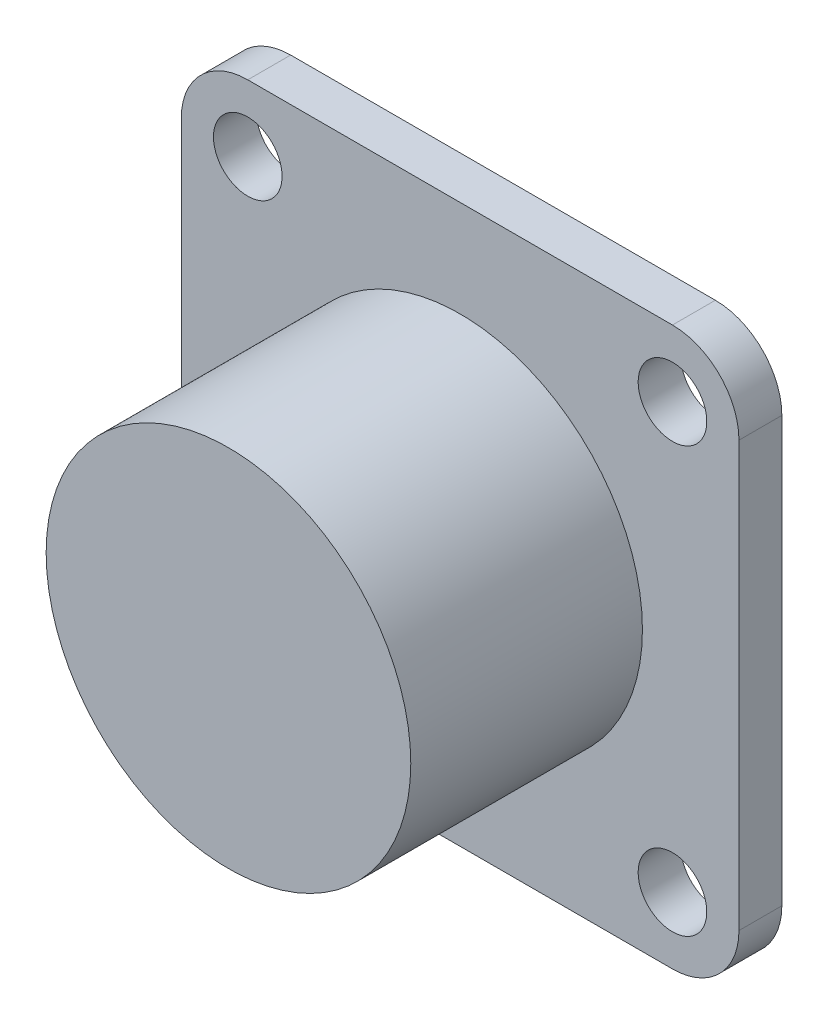
ISO-10303-21;
HEADER;
FILE_DESCRIPTION(('STEP AP214'),'2;1');
FILE_NAME('part.step','',(''),(''),'','','');
FILE_SCHEMA(('AUTOMOTIVE_DESIGN { 1 0 10303 214 1 1 1 1 }'));
ENDSEC;
DATA;
#1=APPLICATION_CONTEXT('core data for automotive mechanical design processes');
#2=APPLICATION_PROTOCOL_DEFINITION('international standard','automotive_design',2000,#1);
#3=PRODUCT_CONTEXT('',#1,'mechanical');
#4=PRODUCT('Part','Part','',(#3));
#5=PRODUCT_RELATED_PRODUCT_CATEGORY('part','',(#4));
#6=PRODUCT_DEFINITION_FORMATION('','',#4);
#7=PRODUCT_DEFINITION_CONTEXT('part definition',#1,'design');
#8=PRODUCT_DEFINITION('design','',#6,#7);
#9=PRODUCT_DEFINITION_SHAPE('','',#8);
#10=(LENGTH_UNIT() NAMED_UNIT(*) SI_UNIT(.MILLI.,.METRE.));
#11=(NAMED_UNIT(*) PLANE_ANGLE_UNIT() SI_UNIT($,.RADIAN.));
#12=(NAMED_UNIT(*) SI_UNIT($,.STERADIAN.) SOLID_ANGLE_UNIT());
#13=UNCERTAINTY_MEASURE_WITH_UNIT(LENGTH_MEASURE(1.E-05),#10,'distance_accuracy_value','');
#14=(GEOMETRIC_REPRESENTATION_CONTEXT(3) GLOBAL_UNCERTAINTY_ASSIGNED_CONTEXT((#13)) GLOBAL_UNIT_ASSIGNED_CONTEXT((#10,
#11,#12)) REPRESENTATION_CONTEXT('',''));
#15=CARTESIAN_POINT('',(0.,0.,0.));
#16=DIRECTION('',(0.,0.,1.));
#17=DIRECTION('',(1.,0.,0.));
#18=AXIS2_PLACEMENT_3D('',#15,#16,#17);
#19=CARTESIAN_POINT('',(13.,-13.,2.));
#20=DIRECTION('',(-1.,0.,0.));
#21=DIRECTION('',(0.,0.,1.));
#22=AXIS2_PLACEMENT_3D('',#19,#20,#21);
#23=PLANE('',#22);
#24=DIRECTION('',(0.,1.,0.));
#25=VECTOR('',#24,1.);
#26=CARTESIAN_POINT('',(13.,-13.,0.));
#27=LINE('',#26,#25);
#28=CARTESIAN_POINT('',(13.,-9.9,0.));
#29=VERTEX_POINT('',#28);
#30=CARTESIAN_POINT('',(13.,9.89999999999999,0.));
#31=VERTEX_POINT('',#30);
#32=EDGE_CURVE('E130',#29,#31,#27,.T.);
#33=ORIENTED_EDGE('',*,*,#32,.T.);
#34=DIRECTION('',(0.,0.,-1.));
#35=VECTOR('',#34,1.);
#36=CARTESIAN_POINT('',(13.,9.9,2.));
#37=LINE('',#36,#35);
#38=CARTESIAN_POINT('',(13.,9.89999999999999,2.));
#39=VERTEX_POINT('',#38);
#40=EDGE_CURVE('E108',#31,#39,#37,.F.);
#41=ORIENTED_EDGE('',*,*,#40,.T.);
#42=DIRECTION('',(0.,1.,0.));
#43=VECTOR('',#42,1.);
#44=CARTESIAN_POINT('',(13.,-13.,2.));
#45=LINE('',#44,#43);
#46=CARTESIAN_POINT('',(13.,-9.9,2.));
#47=VERTEX_POINT('',#46);
#48=EDGE_CURVE('E140',#47,#39,#45,.T.);
#49=ORIENTED_EDGE('',*,*,#48,.F.);
#50=DIRECTION('',(0.,0.,-1.));
#51=VECTOR('',#50,1.);
#52=CARTESIAN_POINT('',(13.,-9.9,2.));
#53=LINE('',#52,#51);
#54=EDGE_CURVE('E113',#47,#29,#53,.T.);
#55=ORIENTED_EDGE('',*,*,#54,.T.);
#56=EDGE_LOOP('',(#33,#41,#49,#55));
#57=FACE_BOUND('',#56,.T.);
#58=ADVANCED_FACE('F35',(#57),#23,.F.);
#59=CARTESIAN_POINT('',(-13.,13.,2.));
#60=DIRECTION('',(0.,-1.,0.));
#61=DIRECTION('',(0.,0.,-1.));
#62=AXIS2_PLACEMENT_3D('',#59,#60,#61);
#63=PLANE('',#62);
#64=DIRECTION('',(-1.,0.,0.));
#65=VECTOR('',#64,1.);
#66=CARTESIAN_POINT('',(-13.,13.,2.));
#67=LINE('',#66,#65);
#68=CARTESIAN_POINT('',(9.9,13.,2.));
#69=VERTEX_POINT('',#68);
#70=CARTESIAN_POINT('',(-9.9,13.,2.));
#71=VERTEX_POINT('',#70);
#72=EDGE_CURVE('E123',#69,#71,#67,.T.);
#73=ORIENTED_EDGE('',*,*,#72,.F.);
#74=DIRECTION('',(0.,0.,-1.));
#75=VECTOR('',#74,1.);
#76=CARTESIAN_POINT('',(9.9,13.,2.));
#77=LINE('',#76,#75);
#78=CARTESIAN_POINT('',(9.9,13.,0.));
#79=VERTEX_POINT('',#78);
#80=EDGE_CURVE('E107',#69,#79,#77,.T.);
#81=ORIENTED_EDGE('',*,*,#80,.T.);
#82=DIRECTION('',(-1.,0.,0.));
#83=VECTOR('',#82,1.);
#84=CARTESIAN_POINT('',(-13.,13.,0.));
#85=LINE('',#84,#83);
#86=CARTESIAN_POINT('',(-9.9,13.,0.));
#87=VERTEX_POINT('',#86);
#88=EDGE_CURVE('E120',#79,#87,#85,.T.);
#89=ORIENTED_EDGE('',*,*,#88,.T.);
#90=DIRECTION('',(0.,0.,-1.));
#91=VECTOR('',#90,1.);
#92=CARTESIAN_POINT('',(-9.89999999999999,13.,2.));
#93=LINE('',#92,#91);
#94=EDGE_CURVE('E125',#87,#71,#93,.F.);
#95=ORIENTED_EDGE('',*,*,#94,.T.);
#96=EDGE_LOOP('',(#73,#81,#89,#95));
#97=FACE_BOUND('',#96,.T.);
#98=ADVANCED_FACE('F119',(#97),#63,.F.);
#99=CARTESIAN_POINT('',(-13.,-13.,2.));
#100=DIRECTION('',(1.,0.,0.));
#101=DIRECTION('',(0.,0.,-1.));
#102=AXIS2_PLACEMENT_3D('',#99,#100,#101);
#103=PLANE('',#102);
#104=DIRECTION('',(0.,-1.,0.));
#105=VECTOR('',#104,1.);
#106=CARTESIAN_POINT('',(-13.,-13.,0.));
#107=LINE('',#106,#105);
#108=CARTESIAN_POINT('',(-13.,9.89999999999999,0.));
#109=VERTEX_POINT('',#108);
#110=CARTESIAN_POINT('',(-13.,-9.9,0.));
#111=VERTEX_POINT('',#110);
#112=EDGE_CURVE('E129',#109,#111,#107,.T.);
#113=ORIENTED_EDGE('',*,*,#112,.T.);
#114=DIRECTION('',(0.,0.,-1.));
#115=VECTOR('',#114,1.);
#116=CARTESIAN_POINT('',(-13.,-9.9,2.));
#117=LINE('',#116,#115);
#118=CARTESIAN_POINT('',(-13.,-9.9,2.));
#119=VERTEX_POINT('',#118);
#120=EDGE_CURVE('E39',#111,#119,#117,.F.);
#121=ORIENTED_EDGE('',*,*,#120,.T.);
#122=DIRECTION('',(0.,-1.,0.));
#123=VECTOR('',#122,1.);
#124=CARTESIAN_POINT('',(-13.,-13.,2.));
#125=LINE('',#124,#123);
#126=CARTESIAN_POINT('',(-13.,9.89999999999999,2.));
#127=VERTEX_POINT('',#126);
#128=EDGE_CURVE('E167',#127,#119,#125,.T.);
#129=ORIENTED_EDGE('',*,*,#128,.F.);
#130=DIRECTION('',(0.,0.,-1.));
#131=VECTOR('',#130,1.);
#132=CARTESIAN_POINT('',(-13.,9.9,2.));
#133=LINE('',#132,#131);
#134=EDGE_CURVE('E160',#127,#109,#133,.T.);
#135=ORIENTED_EDGE('',*,*,#134,.T.);
#136=EDGE_LOOP('',(#113,#121,#129,#135));
#137=FACE_BOUND('',#136,.T.);
#138=ADVANCED_FACE('F166',(#137),#103,.F.);
#139=CARTESIAN_POINT('',(-13.,-13.,2.));
#140=DIRECTION('',(0.,1.,0.));
#141=DIRECTION('',(0.,0.,1.));
#142=AXIS2_PLACEMENT_3D('',#139,#140,#141);
#143=PLANE('',#142);
#144=DIRECTION('',(1.,0.,0.));
#145=VECTOR('',#144,1.);
#146=CARTESIAN_POINT('',(-13.,-13.,0.));
#147=LINE('',#146,#145);
#148=CARTESIAN_POINT('',(-9.9,-13.,0.));
#149=VERTEX_POINT('',#148);
#150=CARTESIAN_POINT('',(9.9,-13.,0.));
#151=VERTEX_POINT('',#150);
#152=EDGE_CURVE('E133',#149,#151,#147,.T.);
#153=ORIENTED_EDGE('',*,*,#152,.T.);
#154=DIRECTION('',(0.,0.,-1.));
#155=VECTOR('',#154,1.);
#156=CARTESIAN_POINT('',(9.9,-13.,2.));
#157=LINE('',#156,#155);
#158=CARTESIAN_POINT('',(9.9,-13.,2.));
#159=VERTEX_POINT('',#158);
#160=EDGE_CURVE('E51',#151,#159,#157,.F.);
#161=ORIENTED_EDGE('',*,*,#160,.T.);
#162=DIRECTION('',(1.,0.,0.));
#163=VECTOR('',#162,1.);
#164=CARTESIAN_POINT('',(-13.,-13.,2.));
#165=LINE('',#164,#163);
#166=CARTESIAN_POINT('',(-9.9,-13.,2.));
#167=VERTEX_POINT('',#166);
#168=EDGE_CURVE('E141',#167,#159,#165,.T.);
#169=ORIENTED_EDGE('',*,*,#168,.F.);
#170=DIRECTION('',(0.,0.,-1.));
#171=VECTOR('',#170,1.);
#172=CARTESIAN_POINT('',(-9.89999999999999,-13.,2.));
#173=LINE('',#172,#171);
#174=EDGE_CURVE('E157',#167,#149,#173,.T.);
#175=ORIENTED_EDGE('',*,*,#174,.T.);
#176=EDGE_LOOP('',(#153,#161,#169,#175));
#177=FACE_BOUND('',#176,.T.);
#178=ADVANCED_FACE('F176',(#177),#143,.F.);
#179=CARTESIAN_POINT('',(0.,0.,2.));
#180=DIRECTION('',(0.,0.,-1.));
#181=DIRECTION('',(-1.,0.,0.));
#182=AXIS2_PLACEMENT_3D('',#179,#180,#181);
#183=PLANE('',#182);
#184=CARTESIAN_POINT('',(-9.89999999999999,9.9,2.));
#185=DIRECTION('',(0.,0.,-1.));
#186=DIRECTION('',(-1.,0.,0.));
#187=AXIS2_PLACEMENT_3D('',#184,#185,#186);
#188=CIRCLE('',#187,1.59999999999999);
#189=CARTESIAN_POINT('',(-11.5,9.9,2.));
#190=VERTEX_POINT('',#189);
#191=EDGE_CURVE('E206',#190,#190,#188,.T.);
#192=ORIENTED_EDGE('',*,*,#191,.T.);
#193=EDGE_LOOP('',(#192));
#194=FACE_BOUND('',#193,.T.);
#195=CARTESIAN_POINT('',(-9.89999999999999,-9.9,2.));
#196=DIRECTION('',(0.,0.,-1.));
#197=DIRECTION('',(-1.,0.,0.));
#198=AXIS2_PLACEMENT_3D('',#195,#196,#197);
#199=CIRCLE('',#198,1.59999999999999);
#200=CARTESIAN_POINT('',(-11.5,-9.9,2.));
#201=VERTEX_POINT('',#200);
#202=EDGE_CURVE('E200',#201,#201,#199,.T.);
#203=ORIENTED_EDGE('',*,*,#202,.T.);
#204=EDGE_LOOP('',(#203));
#205=FACE_BOUND('',#204,.T.);
#206=CARTESIAN_POINT('',(9.9,-9.9,2.));
#207=DIRECTION('',(0.,0.,-1.));
#208=DIRECTION('',(-1.,0.,0.));
#209=AXIS2_PLACEMENT_3D('',#206,#207,#208);
#210=CIRCLE('',#209,1.59999999999999);
#211=CARTESIAN_POINT('',(8.30000000000001,-9.9,2.));
#212=VERTEX_POINT('',#211);
#213=EDGE_CURVE('E194',#212,#212,#210,.T.);
#214=ORIENTED_EDGE('',*,*,#213,.T.);
#215=EDGE_LOOP('',(#214));
#216=FACE_BOUND('',#215,.T.);
#217=CARTESIAN_POINT('',(9.9,9.9,2.));
#218=DIRECTION('',(0.,0.,-1.));
#219=DIRECTION('',(-1.,0.,0.));
#220=AXIS2_PLACEMENT_3D('',#217,#218,#219);
#221=CIRCLE('',#220,1.59999999999999);
#222=CARTESIAN_POINT('',(8.30000000000001,9.9,2.));
#223=VERTEX_POINT('',#222);
#224=EDGE_CURVE('E188',#223,#223,#221,.T.);
#225=ORIENTED_EDGE('',*,*,#224,.T.);
#226=EDGE_LOOP('',(#225));
#227=FACE_BOUND('',#226,.T.);
#228=CARTESIAN_POINT('',(0.,0.,2.));
#229=DIRECTION('',(0.,0.,-1.));
#230=DIRECTION('',(-1.,0.,0.));
#231=AXIS2_PLACEMENT_3D('',#228,#229,#230);
#232=CIRCLE('',#231,8.5);
#233=CARTESIAN_POINT('',(-8.5,0.,2.));
#234=VERTEX_POINT('',#233);
#235=EDGE_CURVE('E12',#234,#234,#232,.F.);
#236=ORIENTED_EDGE('',*,*,#235,.F.);
#237=EDGE_LOOP('',(#236));
#238=FACE_BOUND('',#237,.T.);
#239=ORIENTED_EDGE('',*,*,#48,.T.);
#240=CARTESIAN_POINT('',(9.9,9.9,2.));
#241=DIRECTION('',(0.,0.,-1.));
#242=DIRECTION('',(-1.,0.,0.));
#243=AXIS2_PLACEMENT_3D('',#240,#241,#242);
#244=CIRCLE('',#243,3.1);
#245=EDGE_CURVE('E155',#39,#69,#244,.F.);
#246=ORIENTED_EDGE('',*,*,#245,.T.);
#247=ORIENTED_EDGE('',*,*,#72,.T.);
#248=CARTESIAN_POINT('',(-9.89999999999999,9.9,2.));
#249=DIRECTION('',(0.,0.,-1.));
#250=DIRECTION('',(-1.,0.,0.));
#251=AXIS2_PLACEMENT_3D('',#248,#249,#250);
#252=CIRCLE('',#251,3.1);
#253=EDGE_CURVE('E150',#71,#127,#252,.F.);
#254=ORIENTED_EDGE('',*,*,#253,.T.);
#255=ORIENTED_EDGE('',*,*,#128,.T.);
#256=CARTESIAN_POINT('',(-9.89999999999999,-9.9,2.));
#257=DIRECTION('',(0.,0.,-1.));
#258=DIRECTION('',(-1.,0.,0.));
#259=AXIS2_PLACEMENT_3D('',#256,#257,#258);
#260=CIRCLE('',#259,3.1);
#261=EDGE_CURVE('E58',#119,#167,#260,.F.);
#262=ORIENTED_EDGE('',*,*,#261,.T.);
#263=ORIENTED_EDGE('',*,*,#168,.T.);
#264=CARTESIAN_POINT('',(9.9,-9.9,2.));
#265=DIRECTION('',(0.,0.,-1.));
#266=DIRECTION('',(-1.,0.,0.));
#267=AXIS2_PLACEMENT_3D('',#264,#265,#266);
#268=CIRCLE('',#267,3.1);
#269=EDGE_CURVE('E153',#159,#47,#268,.F.);
#270=ORIENTED_EDGE('',*,*,#269,.T.);
#271=EDGE_LOOP('',(#239,#246,#247,#254,#255,#262,#263,#270));
#272=FACE_BOUND('',#271,.T.);
#273=ADVANCED_FACE('F170',(#194,#205,#216,#227,#238,#272),#183,.F.);
#274=CARTESIAN_POINT('',(0.,0.,0.));
#275=DIRECTION('',(0.,0.,-1.));
#276=DIRECTION('',(-1.,0.,0.));
#277=AXIS2_PLACEMENT_3D('',#274,#275,#276);
#278=PLANE('',#277);
#279=CARTESIAN_POINT('',(0.,0.,0.));
#280=DIRECTION('',(0.,0.,-1.));
#281=DIRECTION('',(-1.,0.,0.));
#282=AXIS2_PLACEMENT_3D('',#279,#280,#281);
#283=CIRCLE('',#282,8.);
#284=CARTESIAN_POINT('',(-8.,0.,0.));
#285=VERTEX_POINT('',#284);
#286=EDGE_CURVE('E219',#285,#285,#283,.T.);
#287=ORIENTED_EDGE('',*,*,#286,.F.);
#288=EDGE_LOOP('',(#287));
#289=FACE_BOUND('',#288,.T.);
#290=CARTESIAN_POINT('',(-9.89999999999999,9.9,0.));
#291=DIRECTION('',(0.,0.,-1.));
#292=DIRECTION('',(-1.,0.,0.));
#293=AXIS2_PLACEMENT_3D('',#290,#291,#292);
#294=CIRCLE('',#293,1.59999999999999);
#295=CARTESIAN_POINT('',(-11.5,9.9,0.));
#296=VERTEX_POINT('',#295);
#297=EDGE_CURVE('E209',#296,#296,#294,.T.);
#298=ORIENTED_EDGE('',*,*,#297,.F.);
#299=EDGE_LOOP('',(#298));
#300=FACE_BOUND('',#299,.T.);
#301=CARTESIAN_POINT('',(-9.89999999999999,-9.9,0.));
#302=DIRECTION('',(0.,0.,-1.));
#303=DIRECTION('',(-1.,0.,0.));
#304=AXIS2_PLACEMENT_3D('',#301,#302,#303);
#305=CIRCLE('',#304,1.59999999999999);
#306=CARTESIAN_POINT('',(-11.5,-9.9,0.));
#307=VERTEX_POINT('',#306);
#308=EDGE_CURVE('E203',#307,#307,#305,.T.);
#309=ORIENTED_EDGE('',*,*,#308,.F.);
#310=EDGE_LOOP('',(#309));
#311=FACE_BOUND('',#310,.T.);
#312=CARTESIAN_POINT('',(9.9,-9.9,0.));
#313=DIRECTION('',(0.,0.,-1.));
#314=DIRECTION('',(-1.,0.,0.));
#315=AXIS2_PLACEMENT_3D('',#312,#313,#314);
#316=CIRCLE('',#315,1.59999999999999);
#317=CARTESIAN_POINT('',(8.30000000000001,-9.9,0.));
#318=VERTEX_POINT('',#317);
#319=EDGE_CURVE('E197',#318,#318,#316,.T.);
#320=ORIENTED_EDGE('',*,*,#319,.F.);
#321=EDGE_LOOP('',(#320));
#322=FACE_BOUND('',#321,.T.);
#323=CARTESIAN_POINT('',(9.9,9.9,0.));
#324=DIRECTION('',(0.,0.,-1.));
#325=DIRECTION('',(-1.,0.,0.));
#326=AXIS2_PLACEMENT_3D('',#323,#324,#325);
#327=CIRCLE('',#326,1.59999999999999);
#328=CARTESIAN_POINT('',(8.30000000000001,9.9,0.));
#329=VERTEX_POINT('',#328);
#330=EDGE_CURVE('E191',#329,#329,#327,.T.);
#331=ORIENTED_EDGE('',*,*,#330,.F.);
#332=EDGE_LOOP('',(#331));
#333=FACE_BOUND('',#332,.T.);
#334=ORIENTED_EDGE('',*,*,#88,.F.);
#335=CARTESIAN_POINT('',(9.9,9.9,0.));
#336=DIRECTION('',(0.,0.,-1.));
#337=DIRECTION('',(-1.,0.,0.));
#338=AXIS2_PLACEMENT_3D('',#335,#336,#337);
#339=CIRCLE('',#338,3.1);
#340=EDGE_CURVE('E103',#79,#31,#339,.T.);
#341=ORIENTED_EDGE('',*,*,#340,.T.);
#342=ORIENTED_EDGE('',*,*,#32,.F.);
#343=CARTESIAN_POINT('',(9.9,-9.9,0.));
#344=DIRECTION('',(0.,0.,-1.));
#345=DIRECTION('',(-1.,0.,0.));
#346=AXIS2_PLACEMENT_3D('',#343,#344,#345);
#347=CIRCLE('',#346,3.1);
#348=EDGE_CURVE('E114',#29,#151,#347,.T.);
#349=ORIENTED_EDGE('',*,*,#348,.T.);
#350=ORIENTED_EDGE('',*,*,#152,.F.);
#351=CARTESIAN_POINT('',(-9.89999999999999,-9.9,0.));
#352=DIRECTION('',(0.,0.,-1.));
#353=DIRECTION('',(-1.,0.,0.));
#354=AXIS2_PLACEMENT_3D('',#351,#352,#353);
#355=CIRCLE('',#354,3.1);
#356=EDGE_CURVE('E144',#149,#111,#355,.T.);
#357=ORIENTED_EDGE('',*,*,#356,.T.);
#358=ORIENTED_EDGE('',*,*,#112,.F.);
#359=CARTESIAN_POINT('',(-9.89999999999999,9.9,0.));
#360=DIRECTION('',(0.,0.,-1.));
#361=DIRECTION('',(-1.,0.,0.));
#362=AXIS2_PLACEMENT_3D('',#359,#360,#361);
#363=CIRCLE('',#362,3.1);
#364=EDGE_CURVE('E124',#109,#87,#363,.T.);
#365=ORIENTED_EDGE('',*,*,#364,.T.);
#366=EDGE_LOOP('',(#334,#341,#342,#349,#350,#357,#358,#365));
#367=FACE_BOUND('',#366,.T.);
#368=ADVANCED_FACE('F127',(#289,#300,#311,#322,#333,#367),#278,.T.);
#369=CARTESIAN_POINT('',(9.9,9.9,2.));
#370=DIRECTION('',(0.,0.,-1.));
#371=DIRECTION('',(-1.,0.,0.));
#372=AXIS2_PLACEMENT_3D('',#369,#370,#371);
#373=CYLINDRICAL_SURFACE('',#372,3.1);
#374=ORIENTED_EDGE('',*,*,#245,.F.);
#375=ORIENTED_EDGE('',*,*,#40,.F.);
#376=ORIENTED_EDGE('',*,*,#340,.F.);
#377=ORIENTED_EDGE('',*,*,#80,.F.);
#378=EDGE_LOOP('',(#374,#375,#376,#377));
#379=FACE_BOUND('',#378,.T.);
#380=ADVANCED_FACE('F106',(#379),#373,.T.);
#381=CARTESIAN_POINT('',(9.9,-9.9,2.));
#382=DIRECTION('',(0.,0.,-1.));
#383=DIRECTION('',(-1.,0.,0.));
#384=AXIS2_PLACEMENT_3D('',#381,#382,#383);
#385=CYLINDRICAL_SURFACE('',#384,3.1);
#386=ORIENTED_EDGE('',*,*,#269,.F.);
#387=ORIENTED_EDGE('',*,*,#160,.F.);
#388=ORIENTED_EDGE('',*,*,#348,.F.);
#389=ORIENTED_EDGE('',*,*,#54,.F.);
#390=EDGE_LOOP('',(#386,#387,#388,#389));
#391=FACE_BOUND('',#390,.T.);
#392=ADVANCED_FACE('F180',(#391),#385,.T.);
#393=CARTESIAN_POINT('',(-9.89999999999999,-9.9,2.));
#394=DIRECTION('',(0.,0.,-1.));
#395=DIRECTION('',(-1.,0.,0.));
#396=AXIS2_PLACEMENT_3D('',#393,#394,#395);
#397=CYLINDRICAL_SURFACE('',#396,3.1);
#398=ORIENTED_EDGE('',*,*,#261,.F.);
#399=ORIENTED_EDGE('',*,*,#120,.F.);
#400=ORIENTED_EDGE('',*,*,#356,.F.);
#401=ORIENTED_EDGE('',*,*,#174,.F.);
#402=EDGE_LOOP('',(#398,#399,#400,#401));
#403=FACE_BOUND('',#402,.T.);
#404=ADVANCED_FACE('F174',(#403),#397,.T.);
#405=CARTESIAN_POINT('',(-9.89999999999999,9.9,2.));
#406=DIRECTION('',(0.,0.,-1.));
#407=DIRECTION('',(-1.,0.,0.));
#408=AXIS2_PLACEMENT_3D('',#405,#406,#407);
#409=CYLINDRICAL_SURFACE('',#408,3.1);
#410=ORIENTED_EDGE('',*,*,#253,.F.);
#411=ORIENTED_EDGE('',*,*,#94,.F.);
#412=ORIENTED_EDGE('',*,*,#364,.F.);
#413=ORIENTED_EDGE('',*,*,#134,.F.);
#414=EDGE_LOOP('',(#410,#411,#412,#413));
#415=FACE_BOUND('',#414,.T.);
#416=ADVANCED_FACE('F37',(#415),#409,.T.);
#417=CARTESIAN_POINT('',(0.,0.,12.8));
#418=DIRECTION('',(0.,0.,-1.));
#419=DIRECTION('',(-1.,0.,0.));
#420=AXIS2_PLACEMENT_3D('',#417,#418,#419);
#421=CYLINDRICAL_SURFACE('',#420,8.5);
#422=CARTESIAN_POINT('',(0.,0.,12.8));
#423=DIRECTION('',(0.,0.,1.));
#424=DIRECTION('',(1.,0.,0.));
#425=AXIS2_PLACEMENT_3D('',#422,#423,#424);
#426=CIRCLE('',#425,8.5);
#427=CARTESIAN_POINT('',(8.5,0.,12.8));
#428=VERTEX_POINT('',#427);
#429=EDGE_CURVE('E135',#428,#428,#426,.T.);
#430=ORIENTED_EDGE('',*,*,#429,.F.);
#431=EDGE_LOOP('',(#430));
#432=FACE_BOUND('',#431,.T.);
#433=ORIENTED_EDGE('',*,*,#235,.T.);
#434=EDGE_LOOP('',(#433));
#435=FACE_BOUND('',#434,.T.);
#436=ADVANCED_FACE('F254',(#432,#435),#421,.T.);
#437=CARTESIAN_POINT('',(0.,0.,12.8));
#438=DIRECTION('',(0.,0.,1.));
#439=DIRECTION('',(1.,0.,0.));
#440=AXIS2_PLACEMENT_3D('',#437,#438,#439);
#441=PLANE('',#440);
#442=ORIENTED_EDGE('',*,*,#429,.T.);
#443=EDGE_LOOP('',(#442));
#444=FACE_BOUND('',#443,.T.);
#445=ADVANCED_FACE('F244',(#444),#441,.T.);
#446=CARTESIAN_POINT('',(9.9,9.9,0.));
#447=DIRECTION('',(0.,0.,-1.));
#448=DIRECTION('',(-1.,0.,0.));
#449=AXIS2_PLACEMENT_3D('',#446,#447,#448);
#450=CYLINDRICAL_SURFACE('',#449,1.59999999999999);
#451=ORIENTED_EDGE('',*,*,#330,.T.);
#452=EDGE_LOOP('',(#451));
#453=FACE_BOUND('',#452,.T.);
#454=ORIENTED_EDGE('',*,*,#224,.F.);
#455=EDGE_LOOP('',(#454));
#456=FACE_BOUND('',#455,.T.);
#457=ADVANCED_FACE('F240',(#453,#456),#450,.F.);
#458=CARTESIAN_POINT('',(9.9,-9.9,0.));
#459=DIRECTION('',(0.,0.,-1.));
#460=DIRECTION('',(-1.,0.,0.));
#461=AXIS2_PLACEMENT_3D('',#458,#459,#460);
#462=CYLINDRICAL_SURFACE('',#461,1.59999999999999);
#463=ORIENTED_EDGE('',*,*,#319,.T.);
#464=EDGE_LOOP('',(#463));
#465=FACE_BOUND('',#464,.T.);
#466=ORIENTED_EDGE('',*,*,#213,.F.);
#467=EDGE_LOOP('',(#466));
#468=FACE_BOUND('',#467,.T.);
#469=ADVANCED_FACE('F243',(#465,#468),#462,.F.);
#470=CARTESIAN_POINT('',(-9.89999999999999,-9.9,0.));
#471=DIRECTION('',(0.,0.,-1.));
#472=DIRECTION('',(-1.,0.,0.));
#473=AXIS2_PLACEMENT_3D('',#470,#471,#472);
#474=CYLINDRICAL_SURFACE('',#473,1.59999999999999);
#475=ORIENTED_EDGE('',*,*,#308,.T.);
#476=EDGE_LOOP('',(#475));
#477=FACE_BOUND('',#476,.T.);
#478=ORIENTED_EDGE('',*,*,#202,.F.);
#479=EDGE_LOOP('',(#478));
#480=FACE_BOUND('',#479,.T.);
#481=ADVANCED_FACE('F321',(#477,#480),#474,.F.);
#482=CARTESIAN_POINT('',(-9.89999999999999,9.9,0.));
#483=DIRECTION('',(0.,0.,-1.));
#484=DIRECTION('',(-1.,0.,0.));
#485=AXIS2_PLACEMENT_3D('',#482,#483,#484);
#486=CYLINDRICAL_SURFACE('',#485,1.59999999999999);
#487=ORIENTED_EDGE('',*,*,#297,.T.);
#488=EDGE_LOOP('',(#487));
#489=FACE_BOUND('',#488,.T.);
#490=ORIENTED_EDGE('',*,*,#191,.F.);
#491=EDGE_LOOP('',(#490));
#492=FACE_BOUND('',#491,.T.);
#493=ADVANCED_FACE('F331',(#489,#492),#486,.F.);
#494=CARTESIAN_POINT('',(0.,0.,35.4274169979695));
#495=DIRECTION('',(0.,0.,-1.));
#496=DIRECTION('',(-1.,0.,0.));
#497=AXIS2_PLACEMENT_3D('',#494,#495,#496);
#498=CYLINDRICAL_SURFACE('',#497,8.);
#499=ORIENTED_EDGE('',*,*,#286,.T.);
#500=EDGE_LOOP('',(#499));
#501=FACE_BOUND('',#500,.T.);
#502=CARTESIAN_POINT('',(0.,0.,11.8));
#503=DIRECTION('',(0.,0.,1.));
#504=DIRECTION('',(1.,0.,0.));
#505=AXIS2_PLACEMENT_3D('',#502,#503,#504);
#506=CIRCLE('',#505,8.);
#507=CARTESIAN_POINT('',(8.,0.,11.8));
#508=VERTEX_POINT('',#507);
#509=EDGE_CURVE('E213',#508,#508,#506,.F.);
#510=ORIENTED_EDGE('',*,*,#509,.F.);
#511=EDGE_LOOP('',(#510));
#512=FACE_BOUND('',#511,.T.);
#513=ADVANCED_FACE('F225',(#501,#512),#498,.F.);
#514=CARTESIAN_POINT('',(0.,0.,35.4274169979695));
#515=DIRECTION('',(0.,0.,-1.));
#516=DIRECTION('',(-1.,0.,0.));
#517=AXIS2_PLACEMENT_3D('',#514,#515,#516);
#518=CYLINDRICAL_SURFACE('',#517,5.85);
#519=CARTESIAN_POINT('',(0.,0.,0.));
#520=DIRECTION('',(0.,0.,-1.));
#521=DIRECTION('',(-1.,0.,0.));
#522=AXIS2_PLACEMENT_3D('',#519,#520,#521);
#523=CIRCLE('',#522,5.85);
#524=CARTESIAN_POINT('',(-5.85,0.,0.));
#525=VERTEX_POINT('',#524);
#526=EDGE_CURVE('E216',#525,#525,#523,.T.);
#527=ORIENTED_EDGE('',*,*,#526,.F.);
#528=EDGE_LOOP('',(#527));
#529=FACE_BOUND('',#528,.T.);
#530=CARTESIAN_POINT('',(0.,0.,11.8));
#531=DIRECTION('',(0.,0.,1.));
#532=DIRECTION('',(1.,0.,0.));
#533=AXIS2_PLACEMENT_3D('',#530,#531,#532);
#534=CIRCLE('',#533,5.85);
#535=CARTESIAN_POINT('',(5.85,0.,11.8));
#536=VERTEX_POINT('',#535);
#537=EDGE_CURVE('E212',#536,#536,#534,.F.);
#538=ORIENTED_EDGE('',*,*,#537,.T.);
#539=EDGE_LOOP('',(#538));
#540=FACE_BOUND('',#539,.T.);
#541=ADVANCED_FACE('F354',(#529,#540),#518,.T.);
#542=CARTESIAN_POINT('',(0.,0.,11.8));
#543=DIRECTION('',(0.,0.,1.));
#544=DIRECTION('',(1.,0.,0.));
#545=AXIS2_PLACEMENT_3D('',#542,#543,#544);
#546=PLANE('',#545);
#547=ORIENTED_EDGE('',*,*,#509,.T.);
#548=EDGE_LOOP('',(#547));
#549=FACE_BOUND('',#548,.T.);
#550=ORIENTED_EDGE('',*,*,#537,.F.);
#551=EDGE_LOOP('',(#550));
#552=FACE_BOUND('',#551,.T.);
#553=ADVANCED_FACE('F363',(#549,#552),#546,.F.);
#554=ORIENTED_EDGE('',*,*,#526,.T.);
#555=EDGE_LOOP('',(#554));
#556=FACE_BOUND('',#555,.T.);
#557=ADVANCED_FACE('F231',(#556),#278,.T.);
#558=CLOSED_SHELL('',(#58,#98,#138,#178,#273,#368,#380,#392,#404,#416,#436,#445,#457,#469,#481,
#493,#513,#541,#553,#557));
#559=MANIFOLD_SOLID_BREP('B2',#558);
#560=ADVANCED_BREP_SHAPE_REPRESENTATION('',(#18,#559),#14);
#561=SHAPE_DEFINITION_REPRESENTATION(#9,#560);
ENDSEC;
END-ISO-10303-21;
